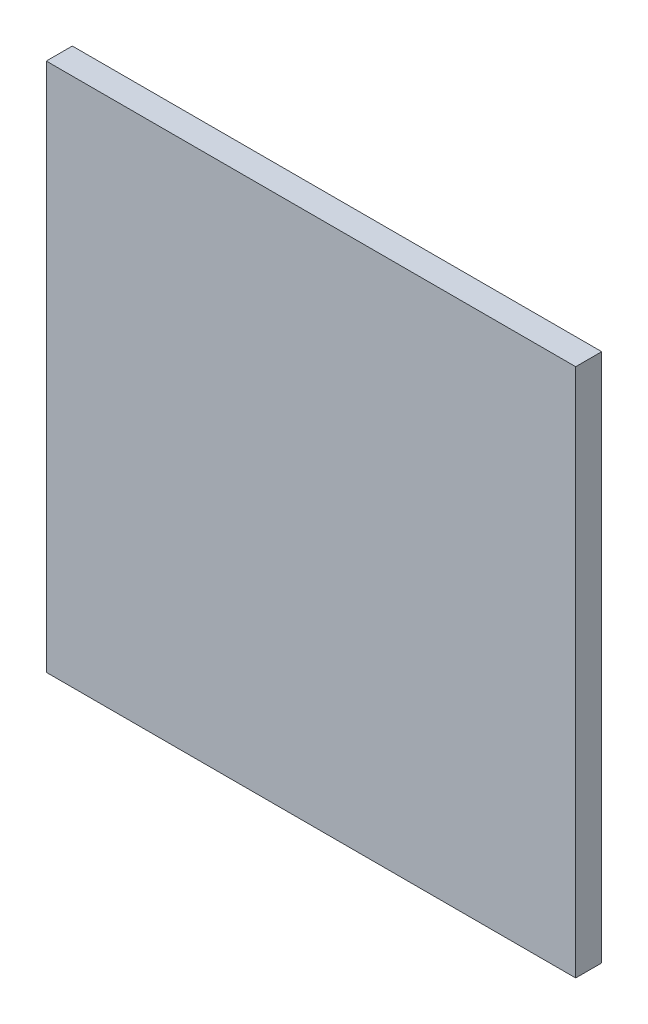
ISO-10303-21;
HEADER;
FILE_DESCRIPTION(('STEP AP214'),'2;1');
FILE_NAME('part.step','',(''),(''),'','','');
FILE_SCHEMA(('AUTOMOTIVE_DESIGN { 1 0 10303 214 1 1 1 1 }'));
ENDSEC;
DATA;
#1=APPLICATION_CONTEXT('core data for automotive mechanical design processes');
#2=APPLICATION_PROTOCOL_DEFINITION('international standard','automotive_design',2000,#1);
#3=PRODUCT_CONTEXT('',#1,'mechanical');
#4=PRODUCT('Part','Part','',(#3));
#5=PRODUCT_RELATED_PRODUCT_CATEGORY('part','',(#4));
#6=PRODUCT_DEFINITION_FORMATION('','',#4);
#7=PRODUCT_DEFINITION_CONTEXT('part definition',#1,'design');
#8=PRODUCT_DEFINITION('design','',#6,#7);
#9=PRODUCT_DEFINITION_SHAPE('','',#8);
#10=(LENGTH_UNIT() NAMED_UNIT(*) SI_UNIT(.MILLI.,.METRE.));
#11=(NAMED_UNIT(*) PLANE_ANGLE_UNIT() SI_UNIT($,.RADIAN.));
#12=(NAMED_UNIT(*) SI_UNIT($,.STERADIAN.) SOLID_ANGLE_UNIT());
#13=UNCERTAINTY_MEASURE_WITH_UNIT(LENGTH_MEASURE(1.E-05),#10,'distance_accuracy_value','');
#14=(GEOMETRIC_REPRESENTATION_CONTEXT(3) GLOBAL_UNCERTAINTY_ASSIGNED_CONTEXT((#13)) GLOBAL_UNIT_ASSIGNED_CONTEXT((#10,
#11,#12)) REPRESENTATION_CONTEXT('',''));
#15=CARTESIAN_POINT('',(0.,0.,0.));
#16=DIRECTION('',(0.,0.,1.));
#17=DIRECTION('',(1.,0.,0.));
#18=AXIS2_PLACEMENT_3D('',#15,#16,#17);
#19=CARTESIAN_POINT('',(152.5,-152.5,15.));
#20=DIRECTION('',(-1.,0.,0.));
#21=DIRECTION('',(0.,0.,1.));
#22=AXIS2_PLACEMENT_3D('',#19,#20,#21);
#23=PLANE('',#22);
#24=DIRECTION('',(0.,1.,0.));
#25=VECTOR('',#24,1.);
#26=CARTESIAN_POINT('',(152.5,-152.5,0.));
#27=LINE('',#26,#25);
#28=CARTESIAN_POINT('',(152.5,-152.5,0.));
#29=VERTEX_POINT('',#28);
#30=CARTESIAN_POINT('',(152.5,152.5,0.));
#31=VERTEX_POINT('',#30);
#32=EDGE_CURVE('E101',#29,#31,#27,.T.);
#33=ORIENTED_EDGE('',*,*,#32,.T.);
#34=DIRECTION('',(0.,0.,-1.));
#35=VECTOR('',#34,1.);
#36=CARTESIAN_POINT('',(152.5,152.5,15.));
#37=LINE('',#36,#35);
#38=CARTESIAN_POINT('',(152.5,152.5,15.));
#39=VERTEX_POINT('',#38);
#40=EDGE_CURVE('E11',#39,#31,#37,.T.);
#41=ORIENTED_EDGE('',*,*,#40,.F.);
#42=DIRECTION('',(0.,1.,0.));
#43=VECTOR('',#42,1.);
#44=CARTESIAN_POINT('',(152.5,-152.5,15.));
#45=LINE('',#44,#43);
#46=CARTESIAN_POINT('',(152.5,-152.5,15.));
#47=VERTEX_POINT('',#46);
#48=EDGE_CURVE('E89',#47,#39,#45,.T.);
#49=ORIENTED_EDGE('',*,*,#48,.F.);
#50=DIRECTION('',(0.,0.,-1.));
#51=VECTOR('',#50,1.);
#52=CARTESIAN_POINT('',(152.5,-152.5,15.));
#53=LINE('',#52,#51);
#54=EDGE_CURVE('E97',#47,#29,#53,.T.);
#55=ORIENTED_EDGE('',*,*,#54,.T.);
#56=EDGE_LOOP('',(#33,#41,#49,#55));
#57=FACE_BOUND('',#56,.T.);
#58=ADVANCED_FACE('F38',(#57),#23,.F.);
#59=CARTESIAN_POINT('',(-152.5,152.5,15.));
#60=DIRECTION('',(0.,-1.,0.));
#61=DIRECTION('',(0.,0.,-1.));
#62=AXIS2_PLACEMENT_3D('',#59,#60,#61);
#63=PLANE('',#62);
#64=DIRECTION('',(-1.,0.,0.));
#65=VECTOR('',#64,1.);
#66=CARTESIAN_POINT('',(-152.5,152.5,0.));
#67=LINE('',#66,#65);
#68=CARTESIAN_POINT('',(-152.5,152.5,0.));
#69=VERTEX_POINT('',#68);
#70=EDGE_CURVE('E93',#31,#69,#67,.T.);
#71=ORIENTED_EDGE('',*,*,#70,.T.);
#72=DIRECTION('',(0.,0.,-1.));
#73=VECTOR('',#72,1.);
#74=CARTESIAN_POINT('',(-152.5,152.5,15.));
#75=LINE('',#74,#73);
#76=CARTESIAN_POINT('',(-152.5,152.5,15.));
#77=VERTEX_POINT('',#76);
#78=EDGE_CURVE('E46',#77,#69,#75,.T.);
#79=ORIENTED_EDGE('',*,*,#78,.F.);
#80=DIRECTION('',(-1.,0.,0.));
#81=VECTOR('',#80,1.);
#82=CARTESIAN_POINT('',(-152.5,152.5,15.));
#83=LINE('',#82,#81);
#84=EDGE_CURVE('E84',#39,#77,#83,.T.);
#85=ORIENTED_EDGE('',*,*,#84,.F.);
#86=ORIENTED_EDGE('',*,*,#40,.T.);
#87=EDGE_LOOP('',(#71,#79,#85,#86));
#88=FACE_BOUND('',#87,.T.);
#89=ADVANCED_FACE('F92',(#88),#63,.F.);
#90=CARTESIAN_POINT('',(-152.5,-152.5,15.));
#91=DIRECTION('',(1.,0.,0.));
#92=DIRECTION('',(0.,0.,-1.));
#93=AXIS2_PLACEMENT_3D('',#90,#91,#92);
#94=PLANE('',#93);
#95=DIRECTION('',(0.,-1.,0.));
#96=VECTOR('',#95,1.);
#97=CARTESIAN_POINT('',(-152.5,-152.5,0.));
#98=LINE('',#97,#96);
#99=CARTESIAN_POINT('',(-152.5,-152.5,0.));
#100=VERTEX_POINT('',#99);
#101=EDGE_CURVE('E71',#69,#100,#98,.T.);
#102=ORIENTED_EDGE('',*,*,#101,.T.);
#103=DIRECTION('',(0.,0.,-1.));
#104=VECTOR('',#103,1.);
#105=CARTESIAN_POINT('',(-152.5,-152.5,15.));
#106=LINE('',#105,#104);
#107=CARTESIAN_POINT('',(-152.5,-152.5,15.));
#108=VERTEX_POINT('',#107);
#109=EDGE_CURVE('E94',#108,#100,#106,.T.);
#110=ORIENTED_EDGE('',*,*,#109,.F.);
#111=DIRECTION('',(0.,-1.,0.));
#112=VECTOR('',#111,1.);
#113=CARTESIAN_POINT('',(-152.5,-152.5,15.));
#114=LINE('',#113,#112);
#115=EDGE_CURVE('E87',#77,#108,#114,.T.);
#116=ORIENTED_EDGE('',*,*,#115,.F.);
#117=ORIENTED_EDGE('',*,*,#78,.T.);
#118=EDGE_LOOP('',(#102,#110,#116,#117));
#119=FACE_BOUND('',#118,.T.);
#120=ADVANCED_FACE('F95',(#119),#94,.F.);
#121=CARTESIAN_POINT('',(-152.5,-152.5,15.));
#122=DIRECTION('',(0.,1.,0.));
#123=DIRECTION('',(0.,0.,1.));
#124=AXIS2_PLACEMENT_3D('',#121,#122,#123);
#125=PLANE('',#124);
#126=DIRECTION('',(1.,0.,0.));
#127=VECTOR('',#126,1.);
#128=CARTESIAN_POINT('',(-152.5,-152.5,0.));
#129=LINE('',#128,#127);
#130=EDGE_CURVE('E77',#100,#29,#129,.T.);
#131=ORIENTED_EDGE('',*,*,#130,.T.);
#132=ORIENTED_EDGE('',*,*,#54,.F.);
#133=DIRECTION('',(1.,0.,0.));
#134=VECTOR('',#133,1.);
#135=CARTESIAN_POINT('',(-152.5,-152.5,15.));
#136=LINE('',#135,#134);
#137=EDGE_CURVE('E54',#108,#47,#136,.T.);
#138=ORIENTED_EDGE('',*,*,#137,.F.);
#139=ORIENTED_EDGE('',*,*,#109,.T.);
#140=EDGE_LOOP('',(#131,#132,#138,#139));
#141=FACE_BOUND('',#140,.T.);
#142=ADVANCED_FACE('F108',(#141),#125,.F.);
#143=CARTESIAN_POINT('',(0.,0.,15.));
#144=DIRECTION('',(0.,0.,-1.));
#145=DIRECTION('',(-1.,0.,0.));
#146=AXIS2_PLACEMENT_3D('',#143,#144,#145);
#147=PLANE('',#146);
#148=ORIENTED_EDGE('',*,*,#48,.T.);
#149=ORIENTED_EDGE('',*,*,#84,.T.);
#150=ORIENTED_EDGE('',*,*,#115,.T.);
#151=ORIENTED_EDGE('',*,*,#137,.T.);
#152=EDGE_LOOP('',(#148,#149,#150,#151));
#153=FACE_BOUND('',#152,.T.);
#154=ADVANCED_FACE('F85',(#153),#147,.F.);
#155=CARTESIAN_POINT('',(0.,0.,0.));
#156=DIRECTION('',(0.,0.,-1.));
#157=DIRECTION('',(-1.,0.,0.));
#158=AXIS2_PLACEMENT_3D('',#155,#156,#157);
#159=PLANE('',#158);
#160=ORIENTED_EDGE('',*,*,#32,.F.);
#161=ORIENTED_EDGE('',*,*,#130,.F.);
#162=ORIENTED_EDGE('',*,*,#101,.F.);
#163=ORIENTED_EDGE('',*,*,#70,.F.);
#164=EDGE_LOOP('',(#160,#161,#162,#163));
#165=FACE_BOUND('',#164,.T.);
#166=ADVANCED_FACE('F111',(#165),#159,.T.);
#167=CLOSED_SHELL('',(#58,#89,#120,#142,#154,#166));
#168=MANIFOLD_SOLID_BREP('B2',#167);
#169=ADVANCED_BREP_SHAPE_REPRESENTATION('',(#18,#168),#14);
#170=SHAPE_DEFINITION_REPRESENTATION(#9,#169);
ENDSEC;
END-ISO-10303-21;
